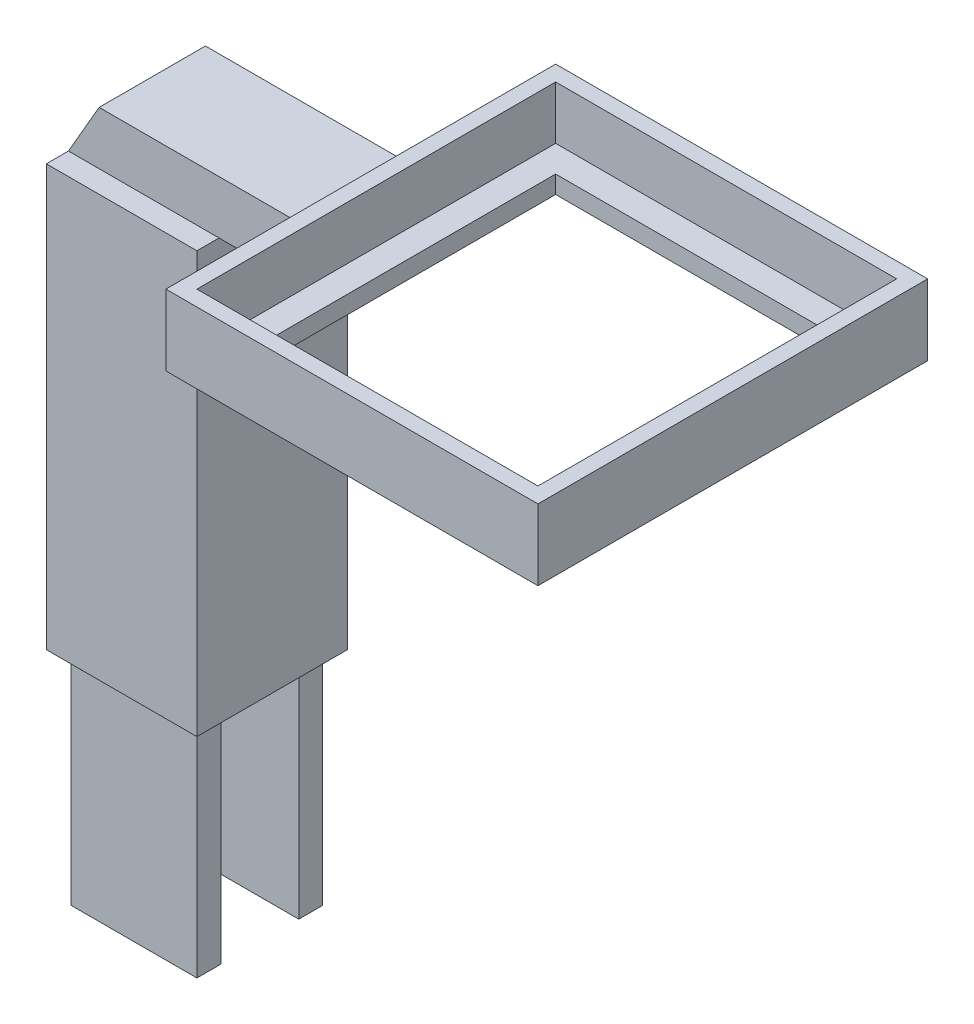
ISO-10303-21;
HEADER;
FILE_DESCRIPTION(('STEP AP214'),'2;1');
FILE_NAME('part.step','',(''),(''),'','','');
FILE_SCHEMA(('AUTOMOTIVE_DESIGN { 1 0 10303 214 1 1 1 1 }'));
ENDSEC;
DATA;
#1=APPLICATION_CONTEXT('core data for automotive mechanical design processes');
#2=APPLICATION_PROTOCOL_DEFINITION('international standard','automotive_design',2000,#1);
#3=PRODUCT_CONTEXT('',#1,'mechanical');
#4=PRODUCT('Part','Part','',(#3));
#5=PRODUCT_RELATED_PRODUCT_CATEGORY('part','',(#4));
#6=PRODUCT_DEFINITION_FORMATION('','',#4);
#7=PRODUCT_DEFINITION_CONTEXT('part definition',#1,'design');
#8=PRODUCT_DEFINITION('design','',#6,#7);
#9=PRODUCT_DEFINITION_SHAPE('','',#8);
#10=(LENGTH_UNIT() NAMED_UNIT(*) SI_UNIT(.MILLI.,.METRE.));
#11=(NAMED_UNIT(*) PLANE_ANGLE_UNIT() SI_UNIT($,.RADIAN.));
#12=(NAMED_UNIT(*) SI_UNIT($,.STERADIAN.) SOLID_ANGLE_UNIT());
#13=UNCERTAINTY_MEASURE_WITH_UNIT(LENGTH_MEASURE(1.E-05),#10,'distance_accuracy_value','');
#14=(GEOMETRIC_REPRESENTATION_CONTEXT(3) GLOBAL_UNCERTAINTY_ASSIGNED_CONTEXT((#13)) GLOBAL_UNIT_ASSIGNED_CONTEXT((#10,
#11,#12)) REPRESENTATION_CONTEXT('',''));
#15=CARTESIAN_POINT('',(0.,0.,0.));
#16=DIRECTION('',(0.,0.,1.));
#17=DIRECTION('',(1.,0.,0.));
#18=AXIS2_PLACEMENT_3D('',#15,#16,#17);
#19=CARTESIAN_POINT('',(20.25,80.5,20.25));
#20=DIRECTION('',(1.,0.,0.));
#21=DIRECTION('',(0.,0.,-1.));
#22=AXIS2_PLACEMENT_3D('',#19,#20,#21);
#23=PLANE('',#22);
#24=DIRECTION('',(0.,-1.,0.));
#25=VECTOR('',#24,1.);
#26=CARTESIAN_POINT('',(20.25,80.5,20.25));
#27=LINE('',#26,#25);
#28=CARTESIAN_POINT('',(20.25,80.5,20.25));
#29=VERTEX_POINT('',#28);
#30=CARTESIAN_POINT('',(20.25,74.5,20.25));
#31=VERTEX_POINT('',#30);
#32=EDGE_CURVE('E369',#29,#31,#27,.T.);
#33=ORIENTED_EDGE('',*,*,#32,.T.);
#34=DIRECTION('',(0.,0.,-1.));
#35=VECTOR('',#34,1.);
#36=CARTESIAN_POINT('',(20.25,74.5,20.25));
#37=LINE('',#36,#35);
#38=CARTESIAN_POINT('',(20.25,74.5,-20.25));
#39=VERTEX_POINT('',#38);
#40=EDGE_CURVE('E409',#31,#39,#37,.T.);
#41=ORIENTED_EDGE('',*,*,#40,.T.);
#42=DIRECTION('',(0.,-1.,0.));
#43=VECTOR('',#42,1.);
#44=CARTESIAN_POINT('',(20.25,80.5,-20.25));
#45=LINE('',#44,#43);
#46=CARTESIAN_POINT('',(20.25,80.5,-20.25));
#47=VERTEX_POINT('',#46);
#48=EDGE_CURVE('E378',#47,#39,#45,.T.);
#49=ORIENTED_EDGE('',*,*,#48,.F.);
#50=DIRECTION('',(0.,0.,1.));
#51=VECTOR('',#50,1.);
#52=CARTESIAN_POINT('',(20.25,80.5,20.25));
#53=LINE('',#52,#51);
#54=EDGE_CURVE('E388',#47,#29,#53,.T.);
#55=ORIENTED_EDGE('',*,*,#54,.T.);
#56=EDGE_LOOP('',(#33,#41,#49,#55));
#57=FACE_BOUND('',#56,.T.);
#58=ADVANCED_FACE('F35',(#57),#23,.T.);
#59=CARTESIAN_POINT('',(58.75,80.5,20.25));
#60=DIRECTION('',(0.,0.,-1.));
#61=DIRECTION('',(-1.,0.,0.));
#62=AXIS2_PLACEMENT_3D('',#59,#60,#61);
#63=PLANE('',#62);
#64=DIRECTION('',(0.,-1.,0.));
#65=VECTOR('',#64,1.);
#66=CARTESIAN_POINT('',(58.75,80.5,20.25));
#67=LINE('',#66,#65);
#68=CARTESIAN_POINT('',(58.75,80.5,20.25));
#69=VERTEX_POINT('',#68);
#70=CARTESIAN_POINT('',(58.75,74.5,20.25));
#71=VERTEX_POINT('',#70);
#72=EDGE_CURVE('E372',#69,#71,#67,.T.);
#73=ORIENTED_EDGE('',*,*,#72,.T.);
#74=DIRECTION('',(-1.,0.,0.));
#75=VECTOR('',#74,1.);
#76=CARTESIAN_POINT('',(20.25,74.5,20.25));
#77=LINE('',#76,#75);
#78=EDGE_CURVE('E403',#71,#31,#77,.T.);
#79=ORIENTED_EDGE('',*,*,#78,.T.);
#80=ORIENTED_EDGE('',*,*,#32,.F.);
#81=DIRECTION('',(1.,0.,0.));
#82=VECTOR('',#81,1.);
#83=CARTESIAN_POINT('',(58.75,80.5,20.25));
#84=LINE('',#83,#82);
#85=EDGE_CURVE('E386',#29,#69,#84,.T.);
#86=ORIENTED_EDGE('',*,*,#85,.T.);
#87=EDGE_LOOP('',(#73,#79,#80,#86));
#88=FACE_BOUND('',#87,.T.);
#89=ADVANCED_FACE('F571',(#88),#63,.T.);
#90=CARTESIAN_POINT('',(58.75,80.5,20.25));
#91=DIRECTION('',(-1.,0.,0.));
#92=DIRECTION('',(0.,0.,1.));
#93=AXIS2_PLACEMENT_3D('',#90,#91,#92);
#94=PLANE('',#93);
#95=DIRECTION('',(0.,-1.,0.));
#96=VECTOR('',#95,1.);
#97=CARTESIAN_POINT('',(58.75,80.5,-20.25));
#98=LINE('',#97,#96);
#99=CARTESIAN_POINT('',(58.75,80.5,-20.25));
#100=VERTEX_POINT('',#99);
#101=CARTESIAN_POINT('',(58.75,74.5,-20.25));
#102=VERTEX_POINT('',#101);
#103=EDGE_CURVE('E375',#100,#102,#98,.T.);
#104=ORIENTED_EDGE('',*,*,#103,.T.);
#105=DIRECTION('',(0.,0.,1.));
#106=VECTOR('',#105,1.);
#107=CARTESIAN_POINT('',(58.75,74.5,20.25));
#108=LINE('',#107,#106);
#109=EDGE_CURVE('E61',#102,#71,#108,.T.);
#110=ORIENTED_EDGE('',*,*,#109,.T.);
#111=ORIENTED_EDGE('',*,*,#72,.F.);
#112=DIRECTION('',(0.,0.,-1.));
#113=VECTOR('',#112,1.);
#114=CARTESIAN_POINT('',(58.75,80.5,20.25));
#115=LINE('',#114,#113);
#116=EDGE_CURVE('E383',#69,#100,#115,.T.);
#117=ORIENTED_EDGE('',*,*,#116,.T.);
#118=EDGE_LOOP('',(#104,#110,#111,#117));
#119=FACE_BOUND('',#118,.T.);
#120=ADVANCED_FACE('F577',(#119),#94,.T.);
#121=CARTESIAN_POINT('',(58.75,80.5,-20.25));
#122=DIRECTION('',(0.,0.,1.));
#123=DIRECTION('',(1.,0.,0.));
#124=AXIS2_PLACEMENT_3D('',#121,#122,#123);
#125=PLANE('',#124);
#126=ORIENTED_EDGE('',*,*,#48,.T.);
#127=DIRECTION('',(1.,0.,0.));
#128=VECTOR('',#127,1.);
#129=CARTESIAN_POINT('',(20.25,74.5,-20.25));
#130=LINE('',#129,#128);
#131=EDGE_CURVE('E407',#39,#102,#130,.T.);
#132=ORIENTED_EDGE('',*,*,#131,.T.);
#133=ORIENTED_EDGE('',*,*,#103,.F.);
#134=DIRECTION('',(-1.,0.,0.));
#135=VECTOR('',#134,1.);
#136=CARTESIAN_POINT('',(58.75,80.5,-20.25));
#137=LINE('',#136,#135);
#138=EDGE_CURVE('E381',#100,#47,#137,.T.);
#139=ORIENTED_EDGE('',*,*,#138,.T.);
#140=EDGE_LOOP('',(#126,#132,#133,#139));
#141=FACE_BOUND('',#140,.T.);
#142=ADVANCED_FACE('F717',(#141),#125,.T.);
#143=CARTESIAN_POINT('',(0.,72.5,0.));
#144=DIRECTION('',(0.,1.,0.));
#145=DIRECTION('',(0.,0.,1.));
#146=AXIS2_PLACEMENT_3D('',#143,#144,#145);
#147=PLANE('',#146);
#148=DIRECTION('',(0.,0.,-1.));
#149=VECTOR('',#148,1.);
#150=CARTESIAN_POINT('',(8.5,72.5,8.5));
#151=LINE('',#150,#149);
#152=CARTESIAN_POINT('',(8.5,72.5,8.5));
#153=VERTEX_POINT('',#152);
#154=CARTESIAN_POINT('',(8.5,72.5,6.));
#155=VERTEX_POINT('',#154);
#156=EDGE_CURVE('E273',#153,#155,#151,.T.);
#157=ORIENTED_EDGE('',*,*,#156,.T.);
#158=DIRECTION('',(-1.,0.,0.));
#159=VECTOR('',#158,1.);
#160=CARTESIAN_POINT('',(18.5,72.5,6.));
#161=LINE('',#160,#159);
#162=CARTESIAN_POINT('',(-8.5,72.5,6.));
#163=VERTEX_POINT('',#162);
#164=EDGE_CURVE('E44',#155,#163,#161,.T.);
#165=ORIENTED_EDGE('',*,*,#164,.T.);
#166=DIRECTION('',(0.,0.,1.));
#167=VECTOR('',#166,1.);
#168=CARTESIAN_POINT('',(-8.5,72.5,8.5));
#169=LINE('',#168,#167);
#170=CARTESIAN_POINT('',(-8.5,72.5,8.5));
#171=VERTEX_POINT('',#170);
#172=EDGE_CURVE('E290',#163,#171,#169,.T.);
#173=ORIENTED_EDGE('',*,*,#172,.T.);
#174=DIRECTION('',(1.,0.,0.));
#175=VECTOR('',#174,1.);
#176=CARTESIAN_POINT('',(8.5,72.5,8.5));
#177=LINE('',#176,#175);
#178=EDGE_CURVE('E280',#171,#153,#177,.T.);
#179=ORIENTED_EDGE('',*,*,#178,.T.);
#180=EDGE_LOOP('',(#157,#165,#173,#179));
#181=FACE_BOUND('',#180,.T.);
#182=ADVANCED_FACE('F516',(#181),#147,.T.);
#183=CARTESIAN_POINT('',(0.,25.,7.1));
#184=DIRECTION('',(0.,0.,1.));
#185=DIRECTION('',(1.,0.,0.));
#186=AXIS2_PLACEMENT_3D('',#183,#184,#185);
#187=PLANE('',#186);
#188=DIRECTION('',(-1.,0.,0.));
#189=VECTOR('',#188,1.);
#190=CARTESIAN_POINT('',(0.,0.,7.1));
#191=LINE('',#190,#189);
#192=CARTESIAN_POINT('',(7.1,0.,7.1));
#193=VERTEX_POINT('',#192);
#194=CARTESIAN_POINT('',(-7.1,0.,7.1));
#195=VERTEX_POINT('',#194);
#196=EDGE_CURVE('E480',#193,#195,#191,.T.);
#197=ORIENTED_EDGE('',*,*,#196,.F.);
#198=DIRECTION('',(0.,-1.,0.));
#199=VECTOR('',#198,1.);
#200=CARTESIAN_POINT('',(7.1,25.,7.1));
#201=LINE('',#200,#199);
#202=CARTESIAN_POINT('',(7.1,25.,7.1));
#203=VERTEX_POINT('',#202);
#204=EDGE_CURVE('E39',#203,#193,#201,.T.);
#205=ORIENTED_EDGE('',*,*,#204,.F.);
#206=DIRECTION('',(-1.,0.,0.));
#207=VECTOR('',#206,1.);
#208=CARTESIAN_POINT('',(0.,25.,7.1));
#209=LINE('',#208,#207);
#210=CARTESIAN_POINT('',(-7.1,25.,7.1));
#211=VERTEX_POINT('',#210);
#212=EDGE_CURVE('E481',#203,#211,#209,.T.);
#213=ORIENTED_EDGE('',*,*,#212,.T.);
#214=DIRECTION('',(0.,-1.,0.));
#215=VECTOR('',#214,1.);
#216=CARTESIAN_POINT('',(-7.1,25.,7.1));
#217=LINE('',#216,#215);
#218=EDGE_CURVE('E492',#211,#195,#217,.T.);
#219=ORIENTED_EDGE('',*,*,#218,.T.);
#220=EDGE_LOOP('',(#197,#205,#213,#219));
#221=FACE_BOUND('',#220,.T.);
#222=ADVANCED_FACE('F37',(#221),#187,.T.);
#223=CARTESIAN_POINT('',(7.1,25.,0.));
#224=DIRECTION('',(-1.,0.,0.));
#225=DIRECTION('',(0.,0.,1.));
#226=AXIS2_PLACEMENT_3D('',#223,#224,#225);
#227=PLANE('',#226);
#228=DIRECTION('',(0.,0.,-1.));
#229=VECTOR('',#228,1.);
#230=CARTESIAN_POINT('',(7.1,0.,0.));
#231=LINE('',#230,#229);
#232=CARTESIAN_POINT('',(7.1,0.,4.4));
#233=VERTEX_POINT('',#232);
#234=EDGE_CURVE('E495',#193,#233,#231,.T.);
#235=ORIENTED_EDGE('',*,*,#234,.T.);
#236=DIRECTION('',(0.,-1.,0.));
#237=VECTOR('',#236,1.);
#238=CARTESIAN_POINT('',(7.1,25.,4.4));
#239=LINE('',#238,#237);
#240=CARTESIAN_POINT('',(7.1,25.,4.4));
#241=VERTEX_POINT('',#240);
#242=EDGE_CURVE('E504',#241,#233,#239,.T.);
#243=ORIENTED_EDGE('',*,*,#242,.F.);
#244=DIRECTION('',(0.,0.,-1.));
#245=VECTOR('',#244,1.);
#246=CARTESIAN_POINT('',(7.1,25.,0.));
#247=LINE('',#246,#245);
#248=EDGE_CURVE('E484',#203,#241,#247,.T.);
#249=ORIENTED_EDGE('',*,*,#248,.F.);
#250=ORIENTED_EDGE('',*,*,#204,.T.);
#251=EDGE_LOOP('',(#235,#243,#249,#250));
#252=FACE_BOUND('',#251,.T.);
#253=ADVANCED_FACE('F879',(#252),#227,.F.);
#254=CARTESIAN_POINT('',(0.,25.,4.4));
#255=DIRECTION('',(0.,0.,1.));
#256=DIRECTION('',(1.,0.,0.));
#257=AXIS2_PLACEMENT_3D('',#254,#255,#256);
#258=PLANE('',#257);
#259=DIRECTION('',(-1.,0.,0.));
#260=VECTOR('',#259,1.);
#261=CARTESIAN_POINT('',(0.,0.,4.4));
#262=LINE('',#261,#260);
#263=CARTESIAN_POINT('',(-7.1,0.,4.4));
#264=VERTEX_POINT('',#263);
#265=EDGE_CURVE('E497',#233,#264,#262,.T.);
#266=ORIENTED_EDGE('',*,*,#265,.T.);
#267=DIRECTION('',(0.,-1.,0.));
#268=VECTOR('',#267,1.);
#269=CARTESIAN_POINT('',(-7.1,25.,4.4));
#270=LINE('',#269,#268);
#271=CARTESIAN_POINT('',(-7.1,25.,4.4));
#272=VERTEX_POINT('',#271);
#273=EDGE_CURVE('E503',#272,#264,#270,.T.);
#274=ORIENTED_EDGE('',*,*,#273,.F.);
#275=DIRECTION('',(-1.,0.,0.));
#276=VECTOR('',#275,1.);
#277=CARTESIAN_POINT('',(0.,25.,4.4));
#278=LINE('',#277,#276);
#279=EDGE_CURVE('E487',#241,#272,#278,.T.);
#280=ORIENTED_EDGE('',*,*,#279,.F.);
#281=ORIENTED_EDGE('',*,*,#242,.T.);
#282=EDGE_LOOP('',(#266,#274,#280,#281));
#283=FACE_BOUND('',#282,.T.);
#284=ADVANCED_FACE('F869',(#283),#258,.F.);
#285=CARTESIAN_POINT('',(-7.1,25.,0.));
#286=DIRECTION('',(-1.,0.,0.));
#287=DIRECTION('',(0.,0.,1.));
#288=AXIS2_PLACEMENT_3D('',#285,#286,#287);
#289=PLANE('',#288);
#290=DIRECTION('',(0.,0.,-1.));
#291=VECTOR('',#290,1.);
#292=CARTESIAN_POINT('',(-7.1,0.,0.));
#293=LINE('',#292,#291);
#294=EDGE_CURVE('E485',#195,#264,#293,.T.);
#295=ORIENTED_EDGE('',*,*,#294,.F.);
#296=ORIENTED_EDGE('',*,*,#218,.F.);
#297=DIRECTION('',(0.,0.,-1.));
#298=VECTOR('',#297,1.);
#299=CARTESIAN_POINT('',(-7.1,25.,0.));
#300=LINE('',#299,#298);
#301=EDGE_CURVE('E489',#211,#272,#300,.T.);
#302=ORIENTED_EDGE('',*,*,#301,.T.);
#303=ORIENTED_EDGE('',*,*,#273,.T.);
#304=EDGE_LOOP('',(#295,#296,#302,#303));
#305=FACE_BOUND('',#304,.T.);
#306=ADVANCED_FACE('F864',(#305),#289,.T.);
#307=CARTESIAN_POINT('',(0.,0.,0.));
#308=DIRECTION('',(0.,1.,0.));
#309=DIRECTION('',(0.,0.,1.));
#310=AXIS2_PLACEMENT_3D('',#307,#308,#309);
#311=PLANE('',#310);
#312=ORIENTED_EDGE('',*,*,#196,.T.);
#313=ORIENTED_EDGE('',*,*,#294,.T.);
#314=ORIENTED_EDGE('',*,*,#265,.F.);
#315=ORIENTED_EDGE('',*,*,#234,.F.);
#316=EDGE_LOOP('',(#312,#313,#314,#315));
#317=FACE_BOUND('',#316,.T.);
#318=ADVANCED_FACE('F777',(#317),#311,.F.);
#319=CARTESIAN_POINT('',(-8.5,72.5,8.5));
#320=DIRECTION('',(1.,0.,0.));
#321=DIRECTION('',(0.,0.,-1.));
#322=AXIS2_PLACEMENT_3D('',#319,#320,#321);
#323=PLANE('',#322);
#324=DIRECTION('',(0.,0.,1.));
#325=VECTOR('',#324,1.);
#326=CARTESIAN_POINT('',(-8.5,25.,8.5));
#327=LINE('',#326,#325);
#328=CARTESIAN_POINT('',(-8.5,25.,-8.5));
#329=VERTEX_POINT('',#328);
#330=CARTESIAN_POINT('',(-8.5,25.,8.5));
#331=VERTEX_POINT('',#330);
#332=EDGE_CURVE('E309',#329,#331,#327,.T.);
#333=ORIENTED_EDGE('',*,*,#332,.T.);
#334=DIRECTION('',(0.,-1.,0.));
#335=VECTOR('',#334,1.);
#336=CARTESIAN_POINT('',(-8.5,72.5,8.5));
#337=LINE('',#336,#335);
#338=EDGE_CURVE('E477',#171,#331,#337,.T.);
#339=ORIENTED_EDGE('',*,*,#338,.F.);
#340=ORIENTED_EDGE('',*,*,#172,.F.);
#341=DIRECTION('',(0.,0.,-1.));
#342=VECTOR('',#341,1.);
#343=CARTESIAN_POINT('',(-8.5,72.5,6.));
#344=LINE('',#343,#342);
#345=CARTESIAN_POINT('',(-8.5,72.5,-6.));
#346=VERTEX_POINT('',#345);
#347=EDGE_CURVE('E326',#163,#346,#344,.T.);
#348=ORIENTED_EDGE('',*,*,#347,.T.);
#349=CARTESIAN_POINT('',(-8.5,72.5,-8.5));
#350=VERTEX_POINT('',#349);
#351=EDGE_CURVE('E285',#350,#346,#169,.T.);
#352=ORIENTED_EDGE('',*,*,#351,.F.);
#353=DIRECTION('',(0.,-1.,0.));
#354=VECTOR('',#353,1.);
#355=CARTESIAN_POINT('',(-8.5,72.5,-8.5));
#356=LINE('',#355,#354);
#357=EDGE_CURVE('E461',#350,#329,#356,.T.);
#358=ORIENTED_EDGE('',*,*,#357,.T.);
#359=EDGE_LOOP('',(#333,#339,#340,#348,#352,#358));
#360=FACE_BOUND('',#359,.T.);
#361=ADVANCED_FACE('F520',(#360),#323,.F.);
#362=CARTESIAN_POINT('',(8.5,72.5,8.5));
#363=DIRECTION('',(0.,0.,-1.));
#364=DIRECTION('',(-1.,0.,0.));
#365=AXIS2_PLACEMENT_3D('',#362,#363,#364);
#366=PLANE('',#365);
#367=DIRECTION('',(1.,0.,0.));
#368=VECTOR('',#367,1.);
#369=CARTESIAN_POINT('',(8.5,25.,8.5));
#370=LINE('',#369,#368);
#371=CARTESIAN_POINT('',(8.5,25.,8.5));
#372=VERTEX_POINT('',#371);
#373=EDGE_CURVE('E471',#331,#372,#370,.T.);
#374=ORIENTED_EDGE('',*,*,#373,.T.);
#375=DIRECTION('',(0.,-1.,0.));
#376=VECTOR('',#375,1.);
#377=CARTESIAN_POINT('',(8.5,72.5,8.5));
#378=LINE('',#377,#376);
#379=EDGE_CURVE('E460',#153,#372,#378,.T.);
#380=ORIENTED_EDGE('',*,*,#379,.F.);
#381=ORIENTED_EDGE('',*,*,#178,.F.);
#382=ORIENTED_EDGE('',*,*,#338,.T.);
#383=EDGE_LOOP('',(#374,#380,#381,#382));
#384=FACE_BOUND('',#383,.T.);
#385=ADVANCED_FACE('F524',(#384),#366,.F.);
#386=CARTESIAN_POINT('',(8.5,72.5,8.5));
#387=DIRECTION('',(-1.,0.,0.));
#388=DIRECTION('',(0.,0.,1.));
#389=AXIS2_PLACEMENT_3D('',#386,#387,#388);
#390=PLANE('',#389);
#391=DIRECTION('',(0.,0.,-1.));
#392=VECTOR('',#391,1.);
#393=CARTESIAN_POINT('',(8.5,59.5096189432336,3.25));
#394=LINE('',#393,#392);
#395=CARTESIAN_POINT('',(8.5,59.5096189432336,3.25));
#396=VERTEX_POINT('',#395);
#397=CARTESIAN_POINT('',(8.5,59.5096189432336,-3.25));
#398=VERTEX_POINT('',#397);
#399=EDGE_CURVE('E266',#396,#398,#394,.T.);
#400=ORIENTED_EDGE('',*,*,#399,.F.);
#401=DIRECTION('',(0.,-1.,0.));
#402=VECTOR('',#401,1.);
#403=CARTESIAN_POINT('',(8.5,59.5096189432336,3.25));
#404=LINE('',#403,#402);
#405=CARTESIAN_POINT('',(8.5,72.5,3.25));
#406=VERTEX_POINT('',#405);
#407=EDGE_CURVE('E250',#406,#396,#404,.T.);
#408=ORIENTED_EDGE('',*,*,#407,.F.);
#409=EDGE_CURVE('E264',#155,#406,#151,.T.);
#410=ORIENTED_EDGE('',*,*,#409,.F.);
#411=ORIENTED_EDGE('',*,*,#156,.F.);
#412=ORIENTED_EDGE('',*,*,#379,.T.);
#413=DIRECTION('',(0.,0.,-1.));
#414=VECTOR('',#413,1.);
#415=CARTESIAN_POINT('',(8.5,25.,8.5));
#416=LINE('',#415,#414);
#417=CARTESIAN_POINT('',(8.5,25.,-8.5));
#418=VERTEX_POINT('',#417);
#419=EDGE_CURVE('E457',#372,#418,#416,.T.);
#420=ORIENTED_EDGE('',*,*,#419,.T.);
#421=DIRECTION('',(0.,-1.,0.));
#422=VECTOR('',#421,1.);
#423=CARTESIAN_POINT('',(8.5,72.5,-8.5));
#424=LINE('',#423,#422);
#425=CARTESIAN_POINT('',(8.5,72.5,-8.5));
#426=VERTEX_POINT('',#425);
#427=EDGE_CURVE('E453',#426,#418,#424,.T.);
#428=ORIENTED_EDGE('',*,*,#427,.F.);
#429=CARTESIAN_POINT('',(8.5,72.5,-6.));
#430=VERTEX_POINT('',#429);
#431=EDGE_CURVE('E276',#430,#426,#151,.T.);
#432=ORIENTED_EDGE('',*,*,#431,.F.);
#433=CARTESIAN_POINT('',(8.5,72.5,-3.25));
#434=VERTEX_POINT('',#433);
#435=EDGE_CURVE('E274',#434,#430,#151,.T.);
#436=ORIENTED_EDGE('',*,*,#435,.F.);
#437=DIRECTION('',(0.,-1.,0.));
#438=VECTOR('',#437,1.);
#439=CARTESIAN_POINT('',(8.5,59.5096189432336,-3.25));
#440=LINE('',#439,#438);
#441=EDGE_CURVE('E53',#434,#398,#440,.T.);
#442=ORIENTED_EDGE('',*,*,#441,.T.);
#443=EDGE_LOOP('',(#400,#408,#410,#411,#412,#420,#428,#432,#436,#442));
#444=FACE_BOUND('',#443,.T.);
#445=ADVANCED_FACE('F262',(#444),#390,.F.);
#446=CARTESIAN_POINT('',(8.5,72.5,-8.5));
#447=DIRECTION('',(0.,0.,1.));
#448=DIRECTION('',(1.,0.,0.));
#449=AXIS2_PLACEMENT_3D('',#446,#447,#448);
#450=PLANE('',#449);
#451=DIRECTION('',(-1.,0.,0.));
#452=VECTOR('',#451,1.);
#453=CARTESIAN_POINT('',(8.5,25.,-8.5));
#454=LINE('',#453,#452);
#455=EDGE_CURVE('E474',#418,#329,#454,.T.);
#456=ORIENTED_EDGE('',*,*,#455,.T.);
#457=ORIENTED_EDGE('',*,*,#357,.F.);
#458=DIRECTION('',(-1.,0.,0.));
#459=VECTOR('',#458,1.);
#460=CARTESIAN_POINT('',(8.5,72.5,-8.5));
#461=LINE('',#460,#459);
#462=EDGE_CURVE('E277',#426,#350,#461,.T.);
#463=ORIENTED_EDGE('',*,*,#462,.F.);
#464=ORIENTED_EDGE('',*,*,#427,.T.);
#465=EDGE_LOOP('',(#456,#457,#463,#464));
#466=FACE_BOUND('',#465,.T.);
#467=ADVANCED_FACE('F464',(#466),#450,.F.);
#468=DIRECTION('',(-1.,0.,0.));
#469=VECTOR('',#468,1.);
#470=CARTESIAN_POINT('',(18.5,72.5,-6.));
#471=LINE('',#470,#469);
#472=EDGE_CURVE('E11',#430,#346,#471,.T.);
#473=ORIENTED_EDGE('',*,*,#472,.F.);
#474=ORIENTED_EDGE('',*,*,#431,.T.);
#475=ORIENTED_EDGE('',*,*,#462,.T.);
#476=ORIENTED_EDGE('',*,*,#351,.T.);
#477=EDGE_LOOP('',(#473,#474,#475,#476));
#478=FACE_BOUND('',#477,.T.);
#479=ADVANCED_FACE('F527',(#478),#147,.T.);
#480=CARTESIAN_POINT('',(0.,25.,0.));
#481=DIRECTION('',(0.,1.,0.));
#482=DIRECTION('',(0.,0.,1.));
#483=AXIS2_PLACEMENT_3D('',#480,#481,#482);
#484=PLANE('',#483);
#485=DIRECTION('',(0.,0.,-1.));
#486=VECTOR('',#485,1.);
#487=CARTESIAN_POINT('',(-7.1,25.,0.));
#488=LINE('',#487,#486);
#489=CARTESIAN_POINT('',(-7.1,25.,-4.4));
#490=VERTEX_POINT('',#489);
#491=CARTESIAN_POINT('',(-7.1,25.,-7.1));
#492=VERTEX_POINT('',#491);
#493=EDGE_CURVE('E302',#490,#492,#488,.T.);
#494=ORIENTED_EDGE('',*,*,#493,.F.);
#495=DIRECTION('',(-1.,0.,0.));
#496=VECTOR('',#495,1.);
#497=CARTESIAN_POINT('',(0.,25.,-4.4));
#498=LINE('',#497,#496);
#499=CARTESIAN_POINT('',(7.1,25.,-4.4));
#500=VERTEX_POINT('',#499);
#501=EDGE_CURVE('E293',#500,#490,#498,.T.);
#502=ORIENTED_EDGE('',*,*,#501,.F.);
#503=DIRECTION('',(0.,0.,-1.));
#504=VECTOR('',#503,1.);
#505=CARTESIAN_POINT('',(7.1,25.,0.));
#506=LINE('',#505,#504);
#507=CARTESIAN_POINT('',(7.1,25.,-7.1));
#508=VERTEX_POINT('',#507);
#509=EDGE_CURVE('E296',#500,#508,#506,.T.);
#510=ORIENTED_EDGE('',*,*,#509,.T.);
#511=DIRECTION('',(-1.,0.,0.));
#512=VECTOR('',#511,1.);
#513=CARTESIAN_POINT('',(0.,25.,-7.1));
#514=LINE('',#513,#512);
#515=EDGE_CURVE('E299',#508,#492,#514,.T.);
#516=ORIENTED_EDGE('',*,*,#515,.T.);
#517=EDGE_LOOP('',(#494,#502,#510,#516));
#518=FACE_BOUND('',#517,.T.);
#519=ORIENTED_EDGE('',*,*,#212,.F.);
#520=ORIENTED_EDGE('',*,*,#248,.T.);
#521=ORIENTED_EDGE('',*,*,#279,.T.);
#522=ORIENTED_EDGE('',*,*,#301,.F.);
#523=EDGE_LOOP('',(#519,#520,#521,#522));
#524=FACE_BOUND('',#523,.T.);
#525=ORIENTED_EDGE('',*,*,#332,.F.);
#526=ORIENTED_EDGE('',*,*,#455,.F.);
#527=ORIENTED_EDGE('',*,*,#419,.F.);
#528=ORIENTED_EDGE('',*,*,#373,.F.);
#529=EDGE_LOOP('',(#525,#526,#527,#528));
#530=FACE_BOUND('',#529,.T.);
#531=ADVANCED_FACE('F526',(#518,#524,#530),#484,.F.);
#532=CARTESIAN_POINT('',(0.,25.,-4.4));
#533=DIRECTION('',(0.,0.,1.));
#534=DIRECTION('',(1.,0.,0.));
#535=AXIS2_PLACEMENT_3D('',#532,#533,#534);
#536=PLANE('',#535);
#537=DIRECTION('',(-1.,0.,0.));
#538=VECTOR('',#537,1.);
#539=CARTESIAN_POINT('',(0.,0.,-4.4));
#540=LINE('',#539,#538);
#541=CARTESIAN_POINT('',(7.1,0.,-4.4));
#542=VERTEX_POINT('',#541);
#543=CARTESIAN_POINT('',(-7.1,0.,-4.4));
#544=VERTEX_POINT('',#543);
#545=EDGE_CURVE('E306',#542,#544,#540,.T.);
#546=ORIENTED_EDGE('',*,*,#545,.F.);
#547=DIRECTION('',(0.,-1.,0.));
#548=VECTOR('',#547,1.);
#549=CARTESIAN_POINT('',(7.1,25.,-4.4));
#550=LINE('',#549,#548);
#551=EDGE_CURVE('E323',#500,#542,#550,.T.);
#552=ORIENTED_EDGE('',*,*,#551,.F.);
#553=ORIENTED_EDGE('',*,*,#501,.T.);
#554=DIRECTION('',(0.,-1.,0.));
#555=VECTOR('',#554,1.);
#556=CARTESIAN_POINT('',(-7.1,25.,-4.4));
#557=LINE('',#556,#555);
#558=EDGE_CURVE('E305',#490,#544,#557,.T.);
#559=ORIENTED_EDGE('',*,*,#558,.T.);
#560=EDGE_LOOP('',(#546,#552,#553,#559));
#561=FACE_BOUND('',#560,.T.);
#562=ADVANCED_FACE('F827',(#561),#536,.T.);
#563=CARTESIAN_POINT('',(7.1,25.,0.));
#564=DIRECTION('',(-1.,0.,0.));
#565=DIRECTION('',(0.,0.,1.));
#566=AXIS2_PLACEMENT_3D('',#563,#564,#565);
#567=PLANE('',#566);
#568=DIRECTION('',(0.,0.,-1.));
#569=VECTOR('',#568,1.);
#570=CARTESIAN_POINT('',(7.1,0.,0.));
#571=LINE('',#570,#569);
#572=CARTESIAN_POINT('',(7.1,0.,-7.1));
#573=VERTEX_POINT('',#572);
#574=EDGE_CURVE('E310',#542,#573,#571,.T.);
#575=ORIENTED_EDGE('',*,*,#574,.T.);
#576=DIRECTION('',(0.,-1.,0.));
#577=VECTOR('',#576,1.);
#578=CARTESIAN_POINT('',(7.1,25.,-7.1));
#579=LINE('',#578,#577);
#580=EDGE_CURVE('E320',#508,#573,#579,.T.);
#581=ORIENTED_EDGE('',*,*,#580,.F.);
#582=ORIENTED_EDGE('',*,*,#509,.F.);
#583=ORIENTED_EDGE('',*,*,#551,.T.);
#584=EDGE_LOOP('',(#575,#581,#582,#583));
#585=FACE_BOUND('',#584,.T.);
#586=ADVANCED_FACE('F817',(#585),#567,.F.);
#587=CARTESIAN_POINT('',(0.,25.,-7.1));
#588=DIRECTION('',(0.,0.,1.));
#589=DIRECTION('',(1.,0.,0.));
#590=AXIS2_PLACEMENT_3D('',#587,#588,#589);
#591=PLANE('',#590);
#592=DIRECTION('',(-1.,0.,0.));
#593=VECTOR('',#592,1.);
#594=CARTESIAN_POINT('',(0.,0.,-7.1));
#595=LINE('',#594,#593);
#596=CARTESIAN_POINT('',(-7.1,0.,-7.1));
#597=VERTEX_POINT('',#596);
#598=EDGE_CURVE('E312',#573,#597,#595,.T.);
#599=ORIENTED_EDGE('',*,*,#598,.T.);
#600=DIRECTION('',(0.,-1.,0.));
#601=VECTOR('',#600,1.);
#602=CARTESIAN_POINT('',(-7.1,25.,-7.1));
#603=LINE('',#602,#601);
#604=EDGE_CURVE('E318',#492,#597,#603,.T.);
#605=ORIENTED_EDGE('',*,*,#604,.F.);
#606=ORIENTED_EDGE('',*,*,#515,.F.);
#607=ORIENTED_EDGE('',*,*,#580,.T.);
#608=EDGE_LOOP('',(#599,#605,#606,#607));
#609=FACE_BOUND('',#608,.T.);
#610=ADVANCED_FACE('F807',(#609),#591,.F.);
#611=CARTESIAN_POINT('',(-7.1,25.,0.));
#612=DIRECTION('',(-1.,0.,0.));
#613=DIRECTION('',(0.,0.,1.));
#614=AXIS2_PLACEMENT_3D('',#611,#612,#613);
#615=PLANE('',#614);
#616=DIRECTION('',(0.,0.,-1.));
#617=VECTOR('',#616,1.);
#618=CARTESIAN_POINT('',(-7.1,0.,0.));
#619=LINE('',#618,#617);
#620=EDGE_CURVE('E295',#544,#597,#619,.T.);
#621=ORIENTED_EDGE('',*,*,#620,.F.);
#622=ORIENTED_EDGE('',*,*,#558,.F.);
#623=ORIENTED_EDGE('',*,*,#493,.T.);
#624=ORIENTED_EDGE('',*,*,#604,.T.);
#625=EDGE_LOOP('',(#621,#622,#623,#624));
#626=FACE_BOUND('',#625,.T.);
#627=ADVANCED_FACE('F797',(#626),#615,.T.);
#628=CARTESIAN_POINT('',(0.,0.,0.));
#629=DIRECTION('',(0.,1.,0.));
#630=DIRECTION('',(0.,0.,1.));
#631=AXIS2_PLACEMENT_3D('',#628,#629,#630);
#632=PLANE('',#631);
#633=ORIENTED_EDGE('',*,*,#545,.T.);
#634=ORIENTED_EDGE('',*,*,#620,.T.);
#635=ORIENTED_EDGE('',*,*,#598,.F.);
#636=ORIENTED_EDGE('',*,*,#574,.F.);
#637=EDGE_LOOP('',(#633,#634,#635,#636));
#638=FACE_BOUND('',#637,.T.);
#639=ADVANCED_FACE('F695',(#638),#632,.F.);
#640=CARTESIAN_POINT('',(18.5,72.5,6.));
#641=DIRECTION('',(0.,-1.,0.));
#642=DIRECTION('',(0.,0.,-1.));
#643=AXIS2_PLACEMENT_3D('',#640,#641,#642);
#644=PLANE('',#643);
#645=DIRECTION('',(-1.,0.,0.));
#646=VECTOR('',#645,1.);
#647=CARTESIAN_POINT('',(8.5,72.5,3.25));
#648=LINE('',#647,#646);
#649=CARTESIAN_POINT('',(16.,72.5,3.25));
#650=VERTEX_POINT('',#649);
#651=EDGE_CURVE('E247',#650,#406,#648,.T.);
#652=ORIENTED_EDGE('',*,*,#651,.F.);
#653=DIRECTION('',(0.,0.,-1.));
#654=VECTOR('',#653,1.);
#655=CARTESIAN_POINT('',(16.,72.5,3.25));
#656=LINE('',#655,#654);
#657=CARTESIAN_POINT('',(16.,72.5,-3.25));
#658=VERTEX_POINT('',#657);
#659=EDGE_CURVE('E445',#650,#658,#656,.T.);
#660=ORIENTED_EDGE('',*,*,#659,.T.);
#661=DIRECTION('',(-1.,0.,0.));
#662=VECTOR('',#661,1.);
#663=CARTESIAN_POINT('',(8.5,72.5,-3.25));
#664=LINE('',#663,#662);
#665=EDGE_CURVE('E449',#658,#434,#664,.T.);
#666=ORIENTED_EDGE('',*,*,#665,.T.);
#667=ORIENTED_EDGE('',*,*,#435,.T.);
#668=CARTESIAN_POINT('',(18.5,72.5,-6.));
#669=VERTEX_POINT('',#668);
#670=EDGE_CURVE('E46',#669,#430,#471,.T.);
#671=ORIENTED_EDGE('',*,*,#670,.F.);
#672=DIRECTION('',(0.,0.,1.));
#673=VECTOR('',#672,1.);
#674=CARTESIAN_POINT('',(18.5,72.5,22.));
#675=LINE('',#674,#673);
#676=CARTESIAN_POINT('',(18.5,72.5,-22.));
#677=VERTEX_POINT('',#676);
#678=EDGE_CURVE('E399',#677,#669,#675,.T.);
#679=ORIENTED_EDGE('',*,*,#678,.F.);
#680=DIRECTION('',(-1.,0.,0.));
#681=VECTOR('',#680,1.);
#682=CARTESIAN_POINT('',(60.5,72.5,-22.));
#683=LINE('',#682,#681);
#684=CARTESIAN_POINT('',(60.5,72.5,-22.));
#685=VERTEX_POINT('',#684);
#686=EDGE_CURVE('E390',#685,#677,#683,.T.);
#687=ORIENTED_EDGE('',*,*,#686,.F.);
#688=DIRECTION('',(0.,0.,-1.));
#689=VECTOR('',#688,1.);
#690=CARTESIAN_POINT('',(60.5,72.5,22.));
#691=LINE('',#690,#689);
#692=CARTESIAN_POINT('',(60.5,72.5,22.));
#693=VERTEX_POINT('',#692);
#694=EDGE_CURVE('E393',#693,#685,#691,.T.);
#695=ORIENTED_EDGE('',*,*,#694,.F.);
#696=DIRECTION('',(1.,0.,0.));
#697=VECTOR('',#696,1.);
#698=CARTESIAN_POINT('',(60.5,72.5,22.));
#699=LINE('',#698,#697);
#700=CARTESIAN_POINT('',(18.5,72.5,22.));
#701=VERTEX_POINT('',#700);
#702=EDGE_CURVE('E396',#701,#693,#699,.T.);
#703=ORIENTED_EDGE('',*,*,#702,.F.);
#704=CARTESIAN_POINT('',(18.5,72.5,6.));
#705=VERTEX_POINT('',#704);
#706=EDGE_CURVE('E402',#705,#701,#675,.T.);
#707=ORIENTED_EDGE('',*,*,#706,.F.);
#708=EDGE_CURVE('E272',#705,#155,#161,.T.);
#709=ORIENTED_EDGE('',*,*,#708,.T.);
#710=ORIENTED_EDGE('',*,*,#409,.T.);
#711=EDGE_LOOP('',(#652,#660,#666,#667,#671,#679,#687,#695,#703,#707,#709,#710));
#712=FACE_BOUND('',#711,.T.);
#713=DIRECTION('',(0.,0.,-1.));
#714=VECTOR('',#713,1.);
#715=CARTESIAN_POINT('',(23.25,72.5,-17.25));
#716=LINE('',#715,#714);
#717=CARTESIAN_POINT('',(23.25,72.5,17.25));
#718=VERTEX_POINT('',#717);
#719=CARTESIAN_POINT('',(23.25,72.5,-17.25));
#720=VERTEX_POINT('',#719);
#721=EDGE_CURVE('E432',#718,#720,#716,.T.);
#722=ORIENTED_EDGE('',*,*,#721,.F.);
#723=DIRECTION('',(-1.,0.,0.));
#724=VECTOR('',#723,1.);
#725=CARTESIAN_POINT('',(55.75,72.5,17.25));
#726=LINE('',#725,#724);
#727=CARTESIAN_POINT('',(55.75,72.5,17.25));
#728=VERTEX_POINT('',#727);
#729=EDGE_CURVE('E422',#728,#718,#726,.T.);
#730=ORIENTED_EDGE('',*,*,#729,.F.);
#731=DIRECTION('',(0.,0.,1.));
#732=VECTOR('',#731,1.);
#733=CARTESIAN_POINT('',(55.75,72.5,-17.25));
#734=LINE('',#733,#732);
#735=CARTESIAN_POINT('',(55.75,72.5,-17.25));
#736=VERTEX_POINT('',#735);
#737=EDGE_CURVE('E426',#736,#728,#734,.T.);
#738=ORIENTED_EDGE('',*,*,#737,.F.);
#739=DIRECTION('',(1.,0.,0.));
#740=VECTOR('',#739,1.);
#741=CARTESIAN_POINT('',(55.75,72.5,-17.25));
#742=LINE('',#741,#740);
#743=EDGE_CURVE('E429',#720,#736,#742,.T.);
#744=ORIENTED_EDGE('',*,*,#743,.F.);
#745=EDGE_LOOP('',(#722,#730,#738,#744));
#746=FACE_BOUND('',#745,.T.);
#747=ADVANCED_FACE('F269',(#712,#746),#644,.T.);
#748=CARTESIAN_POINT('',(-5.0358983848622,78.5,6.));
#749=DIRECTION('',(0.,1.,0.));
#750=DIRECTION('',(0.,0.,1.));
#751=AXIS2_PLACEMENT_3D('',#748,#749,#750);
#752=PLANE('',#751);
#753=DIRECTION('',(1.,0.,0.));
#754=VECTOR('',#753,1.);
#755=CARTESIAN_POINT('',(-5.0358983848622,78.5,-6.));
#756=LINE('',#755,#754);
#757=CARTESIAN_POINT('',(-5.0358983848622,78.5,-6.));
#758=VERTEX_POINT('',#757);
#759=CARTESIAN_POINT('',(18.5,78.5,-6.));
#760=VERTEX_POINT('',#759);
#761=EDGE_CURVE('E336',#758,#760,#756,.T.);
#762=ORIENTED_EDGE('',*,*,#761,.F.);
#763=DIRECTION('',(0.,0.,-1.));
#764=VECTOR('',#763,1.);
#765=CARTESIAN_POINT('',(-5.0358983848622,78.5,6.));
#766=LINE('',#765,#764);
#767=CARTESIAN_POINT('',(-5.0358983848622,78.5,6.));
#768=VERTEX_POINT('',#767);
#769=EDGE_CURVE('E329',#768,#758,#766,.T.);
#770=ORIENTED_EDGE('',*,*,#769,.F.);
#771=DIRECTION('',(1.,0.,0.));
#772=VECTOR('',#771,1.);
#773=CARTESIAN_POINT('',(-5.0358983848622,78.5,6.));
#774=LINE('',#773,#772);
#775=CARTESIAN_POINT('',(18.5,78.5,6.));
#776=VERTEX_POINT('',#775);
#777=EDGE_CURVE('E346',#768,#776,#774,.T.);
#778=ORIENTED_EDGE('',*,*,#777,.T.);
#779=DIRECTION('',(0.,0.,-1.));
#780=VECTOR('',#779,1.);
#781=CARTESIAN_POINT('',(18.5,78.5,6.));
#782=LINE('',#781,#780);
#783=EDGE_CURVE('E325',#776,#760,#782,.T.);
#784=ORIENTED_EDGE('',*,*,#783,.T.);
#785=EDGE_LOOP('',(#762,#770,#778,#784));
#786=FACE_BOUND('',#785,.T.);
#787=ADVANCED_FACE('F536',(#786),#752,.T.);
#788=CARTESIAN_POINT('',(-8.5,72.5,6.));
#789=DIRECTION('',(-0.866025403784436,0.500000000000004,0.));
#790=DIRECTION('',(-0.500000000000004,-0.866025403784436,0.));
#791=AXIS2_PLACEMENT_3D('',#788,#789,#790);
#792=PLANE('',#791);
#793=DIRECTION('',(0.500000000000004,0.866025403784436,0.));
#794=VECTOR('',#793,1.);
#795=CARTESIAN_POINT('',(-8.5,72.5,-6.));
#796=LINE('',#795,#794);
#797=EDGE_CURVE('E339',#346,#758,#796,.T.);
#798=ORIENTED_EDGE('',*,*,#797,.F.);
#799=ORIENTED_EDGE('',*,*,#347,.F.);
#800=DIRECTION('',(0.500000000000004,0.866025403784436,0.));
#801=VECTOR('',#800,1.);
#802=CARTESIAN_POINT('',(-8.5,72.5,6.));
#803=LINE('',#802,#801);
#804=EDGE_CURVE('E348',#163,#768,#803,.T.);
#805=ORIENTED_EDGE('',*,*,#804,.T.);
#806=ORIENTED_EDGE('',*,*,#769,.T.);
#807=EDGE_LOOP('',(#798,#799,#805,#806));
#808=FACE_BOUND('',#807,.T.);
#809=ADVANCED_FACE('F532',(#808),#792,.T.);
#810=CARTESIAN_POINT('',(0.,0.,6.));
#811=DIRECTION('',(0.,0.,1.));
#812=DIRECTION('',(1.,0.,0.));
#813=AXIS2_PLACEMENT_3D('',#810,#811,#812);
#814=PLANE('',#813);
#815=ORIENTED_EDGE('',*,*,#708,.F.);
#816=DIRECTION('',(0.,-1.,0.));
#817=VECTOR('',#816,1.);
#818=CARTESIAN_POINT('',(18.5,78.5,6.));
#819=LINE('',#818,#817);
#820=EDGE_CURVE('E330',#776,#705,#819,.T.);
#821=ORIENTED_EDGE('',*,*,#820,.F.);
#822=ORIENTED_EDGE('',*,*,#777,.F.);
#823=ORIENTED_EDGE('',*,*,#804,.F.);
#824=ORIENTED_EDGE('',*,*,#164,.F.);
#825=EDGE_LOOP('',(#815,#821,#822,#823,#824));
#826=FACE_BOUND('',#825,.T.);
#827=ADVANCED_FACE('F559',(#826),#814,.T.);
#828=CARTESIAN_POINT('',(0.,0.,-6.));
#829=DIRECTION('',(0.,0.,1.));
#830=DIRECTION('',(1.,0.,0.));
#831=AXIS2_PLACEMENT_3D('',#828,#829,#830);
#832=PLANE('',#831);
#833=ORIENTED_EDGE('',*,*,#670,.T.);
#834=ORIENTED_EDGE('',*,*,#472,.T.);
#835=ORIENTED_EDGE('',*,*,#797,.T.);
#836=ORIENTED_EDGE('',*,*,#761,.T.);
#837=DIRECTION('',(0.,-1.,0.));
#838=VECTOR('',#837,1.);
#839=CARTESIAN_POINT('',(18.5,78.5,-6.));
#840=LINE('',#839,#838);
#841=EDGE_CURVE('E333',#760,#669,#840,.T.);
#842=ORIENTED_EDGE('',*,*,#841,.T.);
#843=EDGE_LOOP('',(#833,#834,#835,#836,#842));
#844=FACE_BOUND('',#843,.T.);
#845=ADVANCED_FACE('F530',(#844),#832,.F.);
#846=CARTESIAN_POINT('',(0.,80.5,0.));
#847=DIRECTION('',(0.,1.,0.));
#848=DIRECTION('',(0.,0.,1.));
#849=AXIS2_PLACEMENT_3D('',#846,#847,#848);
#850=PLANE('',#849);
#851=DIRECTION('',(0.,0.,1.));
#852=VECTOR('',#851,1.);
#853=CARTESIAN_POINT('',(18.5,80.5,22.));
#854=LINE('',#853,#852);
#855=CARTESIAN_POINT('',(18.5,80.5,-22.));
#856=VERTEX_POINT('',#855);
#857=CARTESIAN_POINT('',(18.5,80.5,22.));
#858=VERTEX_POINT('',#857);
#859=EDGE_CURVE('E366',#856,#858,#854,.T.);
#860=ORIENTED_EDGE('',*,*,#859,.T.);
#861=DIRECTION('',(1.,0.,0.));
#862=VECTOR('',#861,1.);
#863=CARTESIAN_POINT('',(60.5,80.5,22.));
#864=LINE('',#863,#862);
#865=CARTESIAN_POINT('',(60.5,80.5,22.));
#866=VERTEX_POINT('',#865);
#867=EDGE_CURVE('E364',#858,#866,#864,.T.);
#868=ORIENTED_EDGE('',*,*,#867,.T.);
#869=DIRECTION('',(0.,0.,-1.));
#870=VECTOR('',#869,1.);
#871=CARTESIAN_POINT('',(60.5,80.5,22.));
#872=LINE('',#871,#870);
#873=CARTESIAN_POINT('',(60.5,80.5,-22.));
#874=VERTEX_POINT('',#873);
#875=EDGE_CURVE('E362',#866,#874,#872,.T.);
#876=ORIENTED_EDGE('',*,*,#875,.T.);
#877=DIRECTION('',(-1.,0.,0.));
#878=VECTOR('',#877,1.);
#879=CARTESIAN_POINT('',(60.5,80.5,-22.));
#880=LINE('',#879,#878);
#881=EDGE_CURVE('E360',#874,#856,#880,.T.);
#882=ORIENTED_EDGE('',*,*,#881,.T.);
#883=EDGE_LOOP('',(#860,#868,#876,#882));
#884=FACE_BOUND('',#883,.T.);
#885=ORIENTED_EDGE('',*,*,#85,.F.);
#886=ORIENTED_EDGE('',*,*,#54,.F.);
#887=ORIENTED_EDGE('',*,*,#138,.F.);
#888=ORIENTED_EDGE('',*,*,#116,.F.);
#889=EDGE_LOOP('',(#885,#886,#887,#888));
#890=FACE_BOUND('',#889,.T.);
#891=ADVANCED_FACE('F566',(#884,#890),#850,.T.);
#892=CARTESIAN_POINT('',(18.5,80.5,22.));
#893=DIRECTION('',(1.,0.,0.));
#894=DIRECTION('',(0.,0.,-1.));
#895=AXIS2_PLACEMENT_3D('',#892,#893,#894);
#896=PLANE('',#895);
#897=ORIENTED_EDGE('',*,*,#841,.F.);
#898=ORIENTED_EDGE('',*,*,#783,.F.);
#899=ORIENTED_EDGE('',*,*,#820,.T.);
#900=ORIENTED_EDGE('',*,*,#706,.T.);
#901=DIRECTION('',(0.,-1.,0.));
#902=VECTOR('',#901,1.);
#903=CARTESIAN_POINT('',(18.5,80.5,22.));
#904=LINE('',#903,#902);
#905=EDGE_CURVE('E343',#858,#701,#904,.T.);
#906=ORIENTED_EDGE('',*,*,#905,.F.);
#907=ORIENTED_EDGE('',*,*,#859,.F.);
#908=DIRECTION('',(0.,-1.,0.));
#909=VECTOR('',#908,1.);
#910=CARTESIAN_POINT('',(18.5,80.5,-22.));
#911=LINE('',#910,#909);
#912=EDGE_CURVE('E358',#856,#677,#911,.T.);
#913=ORIENTED_EDGE('',*,*,#912,.T.);
#914=ORIENTED_EDGE('',*,*,#678,.T.);
#915=EDGE_LOOP('',(#897,#898,#899,#900,#906,#907,#913,#914));
#916=FACE_BOUND('',#915,.T.);
#917=ADVANCED_FACE('F540',(#916),#896,.F.);
#918=CARTESIAN_POINT('',(60.5,80.5,22.));
#919=DIRECTION('',(0.,0.,-1.));
#920=DIRECTION('',(-1.,0.,0.));
#921=AXIS2_PLACEMENT_3D('',#918,#919,#920);
#922=PLANE('',#921);
#923=ORIENTED_EDGE('',*,*,#905,.T.);
#924=ORIENTED_EDGE('',*,*,#702,.T.);
#925=DIRECTION('',(0.,-1.,0.));
#926=VECTOR('',#925,1.);
#927=CARTESIAN_POINT('',(60.5,80.5,22.));
#928=LINE('',#927,#926);
#929=EDGE_CURVE('E354',#866,#693,#928,.T.);
#930=ORIENTED_EDGE('',*,*,#929,.F.);
#931=ORIENTED_EDGE('',*,*,#867,.F.);
#932=EDGE_LOOP('',(#923,#924,#930,#931));
#933=FACE_BOUND('',#932,.T.);
#934=ADVANCED_FACE('F556',(#933),#922,.F.);
#935=CARTESIAN_POINT('',(60.5,80.5,22.));
#936=DIRECTION('',(-1.,0.,0.));
#937=DIRECTION('',(0.,0.,1.));
#938=AXIS2_PLACEMENT_3D('',#935,#936,#937);
#939=PLANE('',#938);
#940=ORIENTED_EDGE('',*,*,#929,.T.);
#941=ORIENTED_EDGE('',*,*,#694,.T.);
#942=DIRECTION('',(0.,-1.,0.));
#943=VECTOR('',#942,1.);
#944=CARTESIAN_POINT('',(60.5,80.5,-22.));
#945=LINE('',#944,#943);
#946=EDGE_CURVE('E356',#874,#685,#945,.T.);
#947=ORIENTED_EDGE('',*,*,#946,.F.);
#948=ORIENTED_EDGE('',*,*,#875,.F.);
#949=EDGE_LOOP('',(#940,#941,#947,#948));
#950=FACE_BOUND('',#949,.T.);
#951=ADVANCED_FACE('F552',(#950),#939,.F.);
#952=CARTESIAN_POINT('',(60.5,80.5,-22.));
#953=DIRECTION('',(0.,0.,1.));
#954=DIRECTION('',(1.,0.,0.));
#955=AXIS2_PLACEMENT_3D('',#952,#953,#954);
#956=PLANE('',#955);
#957=ORIENTED_EDGE('',*,*,#946,.T.);
#958=ORIENTED_EDGE('',*,*,#686,.T.);
#959=ORIENTED_EDGE('',*,*,#912,.F.);
#960=ORIENTED_EDGE('',*,*,#881,.F.);
#961=EDGE_LOOP('',(#957,#958,#959,#960));
#962=FACE_BOUND('',#961,.T.);
#963=ADVANCED_FACE('F547',(#962),#956,.F.);
#964=CARTESIAN_POINT('',(0.,74.5,0.));
#965=DIRECTION('',(0.,-1.,0.));
#966=DIRECTION('',(0.,0.,-1.));
#967=AXIS2_PLACEMENT_3D('',#964,#965,#966);
#968=PLANE('',#967);
#969=DIRECTION('',(-1.,0.,0.));
#970=VECTOR('',#969,1.);
#971=CARTESIAN_POINT('',(55.75,74.5,17.25));
#972=LINE('',#971,#970);
#973=CARTESIAN_POINT('',(55.75,74.5,17.25));
#974=VERTEX_POINT('',#973);
#975=CARTESIAN_POINT('',(23.25,74.5,17.25));
#976=VERTEX_POINT('',#975);
#977=EDGE_CURVE('E417',#974,#976,#972,.T.);
#978=ORIENTED_EDGE('',*,*,#977,.T.);
#979=DIRECTION('',(0.,0.,-1.));
#980=VECTOR('',#979,1.);
#981=CARTESIAN_POINT('',(23.25,74.5,-17.25));
#982=LINE('',#981,#980);
#983=CARTESIAN_POINT('',(23.25,74.5,-17.25));
#984=VERTEX_POINT('',#983);
#985=EDGE_CURVE('E425',#976,#984,#982,.T.);
#986=ORIENTED_EDGE('',*,*,#985,.T.);
#987=DIRECTION('',(1.,0.,0.));
#988=VECTOR('',#987,1.);
#989=CARTESIAN_POINT('',(55.75,74.5,-17.25));
#990=LINE('',#989,#988);
#991=CARTESIAN_POINT('',(55.75,74.5,-17.25));
#992=VERTEX_POINT('',#991);
#993=EDGE_CURVE('E439',#984,#992,#990,.T.);
#994=ORIENTED_EDGE('',*,*,#993,.T.);
#995=DIRECTION('',(0.,0.,1.));
#996=VECTOR('',#995,1.);
#997=CARTESIAN_POINT('',(55.75,74.5,-17.25));
#998=LINE('',#997,#996);
#999=EDGE_CURVE('E436',#992,#974,#998,.T.);
#1000=ORIENTED_EDGE('',*,*,#999,.T.);
#1001=EDGE_LOOP('',(#978,#986,#994,#1000));
#1002=FACE_BOUND('',#1001,.T.);
#1003=ORIENTED_EDGE('',*,*,#40,.F.);
#1004=ORIENTED_EDGE('',*,*,#78,.F.);
#1005=ORIENTED_EDGE('',*,*,#109,.F.);
#1006=ORIENTED_EDGE('',*,*,#131,.F.);
#1007=EDGE_LOOP('',(#1003,#1004,#1005,#1006));
#1008=FACE_BOUND('',#1007,.T.);
#1009=ADVANCED_FACE('F587',(#1002,#1008),#968,.F.);
#1010=CARTESIAN_POINT('',(23.25,74.5,-17.25));
#1011=DIRECTION('',(-1.,0.,0.));
#1012=DIRECTION('',(0.,0.,1.));
#1013=AXIS2_PLACEMENT_3D('',#1010,#1011,#1012);
#1014=PLANE('',#1013);
#1015=ORIENTED_EDGE('',*,*,#721,.T.);
#1016=DIRECTION('',(0.,-1.,0.));
#1017=VECTOR('',#1016,1.);
#1018=CARTESIAN_POINT('',(23.25,74.5,-17.25));
#1019=LINE('',#1018,#1017);
#1020=EDGE_CURVE('E413',#984,#720,#1019,.T.);
#1021=ORIENTED_EDGE('',*,*,#1020,.F.);
#1022=ORIENTED_EDGE('',*,*,#985,.F.);
#1023=DIRECTION('',(0.,-1.,0.));
#1024=VECTOR('',#1023,1.);
#1025=CARTESIAN_POINT('',(23.25,74.5,17.25));
#1026=LINE('',#1025,#1024);
#1027=EDGE_CURVE('E412',#976,#718,#1026,.T.);
#1028=ORIENTED_EDGE('',*,*,#1027,.T.);
#1029=EDGE_LOOP('',(#1015,#1021,#1022,#1028));
#1030=FACE_BOUND('',#1029,.T.);
#1031=ADVANCED_FACE('F614',(#1030),#1014,.F.);
#1032=CARTESIAN_POINT('',(55.75,74.5,17.25));
#1033=DIRECTION('',(0.,0.,1.));
#1034=DIRECTION('',(1.,0.,0.));
#1035=AXIS2_PLACEMENT_3D('',#1032,#1033,#1034);
#1036=PLANE('',#1035);
#1037=ORIENTED_EDGE('',*,*,#729,.T.);
#1038=ORIENTED_EDGE('',*,*,#1027,.F.);
#1039=ORIENTED_EDGE('',*,*,#977,.F.);
#1040=DIRECTION('',(0.,-1.,0.));
#1041=VECTOR('',#1040,1.);
#1042=CARTESIAN_POINT('',(55.75,74.5,17.25));
#1043=LINE('',#1042,#1041);
#1044=EDGE_CURVE('E419',#974,#728,#1043,.T.);
#1045=ORIENTED_EDGE('',*,*,#1044,.T.);
#1046=EDGE_LOOP('',(#1037,#1038,#1039,#1045));
#1047=FACE_BOUND('',#1046,.T.);
#1048=ADVANCED_FACE('F623',(#1047),#1036,.F.);
#1049=CARTESIAN_POINT('',(55.75,74.5,-17.25));
#1050=DIRECTION('',(1.,0.,0.));
#1051=DIRECTION('',(0.,0.,-1.));
#1052=AXIS2_PLACEMENT_3D('',#1049,#1050,#1051);
#1053=PLANE('',#1052);
#1054=ORIENTED_EDGE('',*,*,#737,.T.);
#1055=ORIENTED_EDGE('',*,*,#1044,.F.);
#1056=ORIENTED_EDGE('',*,*,#999,.F.);
#1057=DIRECTION('',(0.,-1.,0.));
#1058=VECTOR('',#1057,1.);
#1059=CARTESIAN_POINT('',(55.75,74.5,-17.25));
#1060=LINE('',#1059,#1058);
#1061=EDGE_CURVE('E416',#992,#736,#1060,.T.);
#1062=ORIENTED_EDGE('',*,*,#1061,.T.);
#1063=EDGE_LOOP('',(#1054,#1055,#1056,#1062));
#1064=FACE_BOUND('',#1063,.T.);
#1065=ADVANCED_FACE('F631',(#1064),#1053,.F.);
#1066=CARTESIAN_POINT('',(55.75,74.5,-17.25));
#1067=DIRECTION('',(0.,0.,-1.));
#1068=DIRECTION('',(-1.,0.,0.));
#1069=AXIS2_PLACEMENT_3D('',#1066,#1067,#1068);
#1070=PLANE('',#1069);
#1071=ORIENTED_EDGE('',*,*,#743,.T.);
#1072=ORIENTED_EDGE('',*,*,#1061,.F.);
#1073=ORIENTED_EDGE('',*,*,#993,.F.);
#1074=ORIENTED_EDGE('',*,*,#1020,.T.);
#1075=EDGE_LOOP('',(#1071,#1072,#1073,#1074));
#1076=FACE_BOUND('',#1075,.T.);
#1077=ADVANCED_FACE('F639',(#1076),#1070,.F.);
#1078=CARTESIAN_POINT('',(16.,72.5,3.25));
#1079=DIRECTION('',(-0.866025403784436,0.500000000000004,0.));
#1080=DIRECTION('',(-0.500000000000004,-0.866025403784436,0.));
#1081=AXIS2_PLACEMENT_3D('',#1078,#1079,#1080);
#1082=PLANE('',#1081);
#1083=DIRECTION('',(0.500000000000004,0.866025403784436,0.));
#1084=VECTOR('',#1083,1.);
#1085=CARTESIAN_POINT('',(16.,72.5,-3.25));
#1086=LINE('',#1085,#1084);
#1087=EDGE_CURVE('E257',#398,#658,#1086,.T.);
#1088=ORIENTED_EDGE('',*,*,#1087,.T.);
#1089=ORIENTED_EDGE('',*,*,#659,.F.);
#1090=DIRECTION('',(0.500000000000004,0.866025403784436,0.));
#1091=VECTOR('',#1090,1.);
#1092=CARTESIAN_POINT('',(16.,72.5,3.25));
#1093=LINE('',#1092,#1091);
#1094=EDGE_CURVE('E252',#396,#650,#1093,.T.);
#1095=ORIENTED_EDGE('',*,*,#1094,.F.);
#1096=ORIENTED_EDGE('',*,*,#399,.T.);
#1097=EDGE_LOOP('',(#1088,#1089,#1095,#1096));
#1098=FACE_BOUND('',#1097,.T.);
#1099=ADVANCED_FACE('F647',(#1098),#1082,.F.);
#1100=CARTESIAN_POINT('',(0.,0.,3.25));
#1101=DIRECTION('',(0.,0.,1.));
#1102=DIRECTION('',(1.,0.,0.));
#1103=AXIS2_PLACEMENT_3D('',#1100,#1101,#1102);
#1104=PLANE('',#1103);
#1105=ORIENTED_EDGE('',*,*,#651,.T.);
#1106=ORIENTED_EDGE('',*,*,#407,.T.);
#1107=ORIENTED_EDGE('',*,*,#1094,.T.);
#1108=EDGE_LOOP('',(#1105,#1106,#1107));
#1109=FACE_BOUND('',#1108,.T.);
#1110=ADVANCED_FACE('F249',(#1109),#1104,.T.);
#1111=CARTESIAN_POINT('',(0.,0.,-3.25));
#1112=DIRECTION('',(0.,0.,1.));
#1113=DIRECTION('',(1.,0.,0.));
#1114=AXIS2_PLACEMENT_3D('',#1111,#1112,#1113);
#1115=PLANE('',#1114);
#1116=ORIENTED_EDGE('',*,*,#665,.F.);
#1117=ORIENTED_EDGE('',*,*,#1087,.F.);
#1118=ORIENTED_EDGE('',*,*,#441,.F.);
#1119=EDGE_LOOP('',(#1116,#1117,#1118));
#1120=FACE_BOUND('',#1119,.T.);
#1121=ADVANCED_FACE('F664',(#1120),#1115,.F.);
#1122=CLOSED_SHELL('',(#58,#89,#120,#142,#182,#222,#253,#284,#306,#318,#361,#385,#445,#467,#479,
#531,#562,#586,#610,#627,#639,#747,#787,#809,#827,#845,#891,#917,#934,#951,#963,#1009,#1031,
#1048,#1065,#1077,#1099,#1110,#1121));
#1123=MANIFOLD_SOLID_BREP('B2',#1122);
#1124=ADVANCED_BREP_SHAPE_REPRESENTATION('',(#18,#1123),#14);
#1125=SHAPE_DEFINITION_REPRESENTATION(#9,#1124);
ENDSEC;
END-ISO-10303-21;
